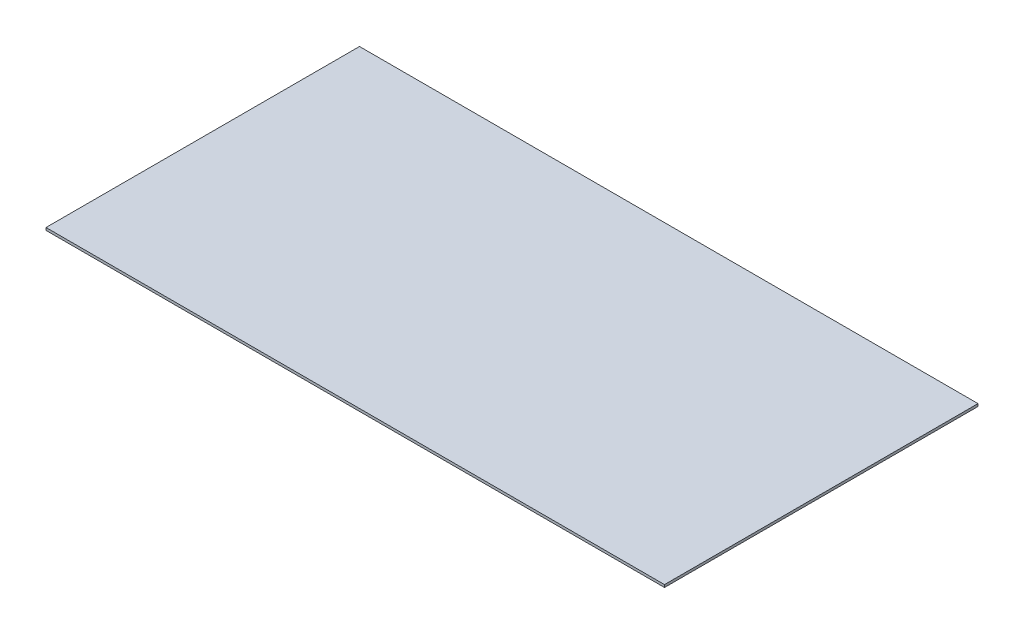
ISO-10303-21;
HEADER;
FILE_DESCRIPTION(('STEP AP214'),'2;1');
FILE_NAME('part.step','',(''),(''),'','','');
FILE_SCHEMA(('AUTOMOTIVE_DESIGN { 1 0 10303 214 1 1 1 1 }'));
ENDSEC;
DATA;
#1=APPLICATION_CONTEXT('core data for automotive mechanical design processes');
#2=APPLICATION_PROTOCOL_DEFINITION('international standard','automotive_design',2000,#1);
#3=PRODUCT_CONTEXT('',#1,'mechanical');
#4=PRODUCT('Part','Part','',(#3));
#5=PRODUCT_RELATED_PRODUCT_CATEGORY('part','',(#4));
#6=PRODUCT_DEFINITION_FORMATION('','',#4);
#7=PRODUCT_DEFINITION_CONTEXT('part definition',#1,'design');
#8=PRODUCT_DEFINITION('design','',#6,#7);
#9=PRODUCT_DEFINITION_SHAPE('','',#8);
#10=(LENGTH_UNIT() NAMED_UNIT(*) SI_UNIT(.MILLI.,.METRE.));
#11=(NAMED_UNIT(*) PLANE_ANGLE_UNIT() SI_UNIT($,.RADIAN.));
#12=(NAMED_UNIT(*) SI_UNIT($,.STERADIAN.) SOLID_ANGLE_UNIT());
#13=UNCERTAINTY_MEASURE_WITH_UNIT(LENGTH_MEASURE(1.E-05),#10,'distance_accuracy_value','');
#14=(GEOMETRIC_REPRESENTATION_CONTEXT(3) GLOBAL_UNCERTAINTY_ASSIGNED_CONTEXT((#13)) GLOBAL_UNIT_ASSIGNED_CONTEXT((#10,
#11,#12)) REPRESENTATION_CONTEXT('',''));
#15=CARTESIAN_POINT('',(0.,0.,0.));
#16=DIRECTION('',(0.,0.,1.));
#17=DIRECTION('',(1.,0.,0.));
#18=AXIS2_PLACEMENT_3D('',#15,#16,#17);
#19=CARTESIAN_POINT('',(365.,3.,185.));
#20=DIRECTION('',(-1.,0.,0.));
#21=DIRECTION('',(0.,0.,1.));
#22=AXIS2_PLACEMENT_3D('',#19,#20,#21);
#23=PLANE('',#22);
#24=DIRECTION('',(0.,0.,-1.));
#25=VECTOR('',#24,1.);
#26=CARTESIAN_POINT('',(365.,0.,185.));
#27=LINE('',#26,#25);
#28=CARTESIAN_POINT('',(365.,0.,185.));
#29=VERTEX_POINT('',#28);
#30=CARTESIAN_POINT('',(365.,0.,-185.));
#31=VERTEX_POINT('',#30);
#32=EDGE_CURVE('E99',#29,#31,#27,.T.);
#33=ORIENTED_EDGE('',*,*,#32,.T.);
#34=DIRECTION('',(0.,-1.,0.));
#35=VECTOR('',#34,1.);
#36=CARTESIAN_POINT('',(365.,3.,-185.));
#37=LINE('',#36,#35);
#38=CARTESIAN_POINT('',(365.,3.,-185.));
#39=VERTEX_POINT('',#38);
#40=EDGE_CURVE('E11',#39,#31,#37,.T.);
#41=ORIENTED_EDGE('',*,*,#40,.F.);
#42=DIRECTION('',(0.,0.,-1.));
#43=VECTOR('',#42,1.);
#44=CARTESIAN_POINT('',(365.,3.,185.));
#45=LINE('',#44,#43);
#46=CARTESIAN_POINT('',(365.,3.,185.));
#47=VERTEX_POINT('',#46);
#48=EDGE_CURVE('E87',#47,#39,#45,.T.);
#49=ORIENTED_EDGE('',*,*,#48,.F.);
#50=DIRECTION('',(0.,-1.,0.));
#51=VECTOR('',#50,1.);
#52=CARTESIAN_POINT('',(365.,3.,185.));
#53=LINE('',#52,#51);
#54=EDGE_CURVE('E95',#47,#29,#53,.T.);
#55=ORIENTED_EDGE('',*,*,#54,.T.);
#56=EDGE_LOOP('',(#33,#41,#49,#55));
#57=FACE_BOUND('',#56,.T.);
#58=ADVANCED_FACE('F36',(#57),#23,.F.);
#59=CARTESIAN_POINT('',(-365.,3.,-185.));
#60=DIRECTION('',(0.,0.,1.));
#61=DIRECTION('',(1.,0.,0.));
#62=AXIS2_PLACEMENT_3D('',#59,#60,#61);
#63=PLANE('',#62);
#64=DIRECTION('',(-1.,0.,0.));
#65=VECTOR('',#64,1.);
#66=CARTESIAN_POINT('',(-365.,0.,-185.));
#67=LINE('',#66,#65);
#68=CARTESIAN_POINT('',(-365.,0.,-185.));
#69=VERTEX_POINT('',#68);
#70=EDGE_CURVE('E91',#31,#69,#67,.T.);
#71=ORIENTED_EDGE('',*,*,#70,.T.);
#72=DIRECTION('',(0.,-1.,0.));
#73=VECTOR('',#72,1.);
#74=CARTESIAN_POINT('',(-365.,3.,-185.));
#75=LINE('',#74,#73);
#76=CARTESIAN_POINT('',(-365.,3.,-185.));
#77=VERTEX_POINT('',#76);
#78=EDGE_CURVE('E44',#77,#69,#75,.T.);
#79=ORIENTED_EDGE('',*,*,#78,.F.);
#80=DIRECTION('',(-1.,0.,0.));
#81=VECTOR('',#80,1.);
#82=CARTESIAN_POINT('',(-365.,3.,-185.));
#83=LINE('',#82,#81);
#84=EDGE_CURVE('E82',#39,#77,#83,.T.);
#85=ORIENTED_EDGE('',*,*,#84,.F.);
#86=ORIENTED_EDGE('',*,*,#40,.T.);
#87=EDGE_LOOP('',(#71,#79,#85,#86));
#88=FACE_BOUND('',#87,.T.);
#89=ADVANCED_FACE('F90',(#88),#63,.F.);
#90=CARTESIAN_POINT('',(-365.,3.,185.));
#91=DIRECTION('',(1.,0.,0.));
#92=DIRECTION('',(0.,0.,-1.));
#93=AXIS2_PLACEMENT_3D('',#90,#91,#92);
#94=PLANE('',#93);
#95=DIRECTION('',(0.,0.,1.));
#96=VECTOR('',#95,1.);
#97=CARTESIAN_POINT('',(-365.,0.,185.));
#98=LINE('',#97,#96);
#99=CARTESIAN_POINT('',(-365.,0.,185.));
#100=VERTEX_POINT('',#99);
#101=EDGE_CURVE('E69',#69,#100,#98,.T.);
#102=ORIENTED_EDGE('',*,*,#101,.T.);
#103=DIRECTION('',(0.,-1.,0.));
#104=VECTOR('',#103,1.);
#105=CARTESIAN_POINT('',(-365.,3.,185.));
#106=LINE('',#105,#104);
#107=CARTESIAN_POINT('',(-365.,3.,185.));
#108=VERTEX_POINT('',#107);
#109=EDGE_CURVE('E92',#108,#100,#106,.T.);
#110=ORIENTED_EDGE('',*,*,#109,.F.);
#111=DIRECTION('',(0.,0.,1.));
#112=VECTOR('',#111,1.);
#113=CARTESIAN_POINT('',(-365.,3.,185.));
#114=LINE('',#113,#112);
#115=EDGE_CURVE('E85',#77,#108,#114,.T.);
#116=ORIENTED_EDGE('',*,*,#115,.F.);
#117=ORIENTED_EDGE('',*,*,#78,.T.);
#118=EDGE_LOOP('',(#102,#110,#116,#117));
#119=FACE_BOUND('',#118,.T.);
#120=ADVANCED_FACE('F93',(#119),#94,.F.);
#121=CARTESIAN_POINT('',(-365.,3.,185.));
#122=DIRECTION('',(0.,0.,-1.));
#123=DIRECTION('',(-1.,0.,0.));
#124=AXIS2_PLACEMENT_3D('',#121,#122,#123);
#125=PLANE('',#124);
#126=DIRECTION('',(1.,0.,0.));
#127=VECTOR('',#126,1.);
#128=CARTESIAN_POINT('',(-365.,0.,185.));
#129=LINE('',#128,#127);
#130=EDGE_CURVE('E75',#100,#29,#129,.T.);
#131=ORIENTED_EDGE('',*,*,#130,.T.);
#132=ORIENTED_EDGE('',*,*,#54,.F.);
#133=DIRECTION('',(1.,0.,0.));
#134=VECTOR('',#133,1.);
#135=CARTESIAN_POINT('',(-365.,3.,185.));
#136=LINE('',#135,#134);
#137=EDGE_CURVE('E52',#108,#47,#136,.T.);
#138=ORIENTED_EDGE('',*,*,#137,.F.);
#139=ORIENTED_EDGE('',*,*,#109,.T.);
#140=EDGE_LOOP('',(#131,#132,#138,#139));
#141=FACE_BOUND('',#140,.T.);
#142=ADVANCED_FACE('F106',(#141),#125,.F.);
#143=CARTESIAN_POINT('',(0.,3.,0.));
#144=DIRECTION('',(0.,-1.,0.));
#145=DIRECTION('',(0.,0.,-1.));
#146=AXIS2_PLACEMENT_3D('',#143,#144,#145);
#147=PLANE('',#146);
#148=ORIENTED_EDGE('',*,*,#48,.T.);
#149=ORIENTED_EDGE('',*,*,#84,.T.);
#150=ORIENTED_EDGE('',*,*,#115,.T.);
#151=ORIENTED_EDGE('',*,*,#137,.T.);
#152=EDGE_LOOP('',(#148,#149,#150,#151));
#153=FACE_BOUND('',#152,.T.);
#154=ADVANCED_FACE('F83',(#153),#147,.F.);
#155=CARTESIAN_POINT('',(0.,0.,0.));
#156=DIRECTION('',(0.,-1.,0.));
#157=DIRECTION('',(0.,0.,-1.));
#158=AXIS2_PLACEMENT_3D('',#155,#156,#157);
#159=PLANE('',#158);
#160=ORIENTED_EDGE('',*,*,#32,.F.);
#161=ORIENTED_EDGE('',*,*,#130,.F.);
#162=ORIENTED_EDGE('',*,*,#101,.F.);
#163=ORIENTED_EDGE('',*,*,#70,.F.);
#164=EDGE_LOOP('',(#160,#161,#162,#163));
#165=FACE_BOUND('',#164,.T.);
#166=ADVANCED_FACE('F109',(#165),#159,.T.);
#167=CLOSED_SHELL('',(#58,#89,#120,#142,#154,#166));
#168=MANIFOLD_SOLID_BREP('B2',#167);
#169=ADVANCED_BREP_SHAPE_REPRESENTATION('',(#18,#168),#14);
#170=SHAPE_DEFINITION_REPRESENTATION(#9,#169);
ENDSEC;
END-ISO-10303-21;
